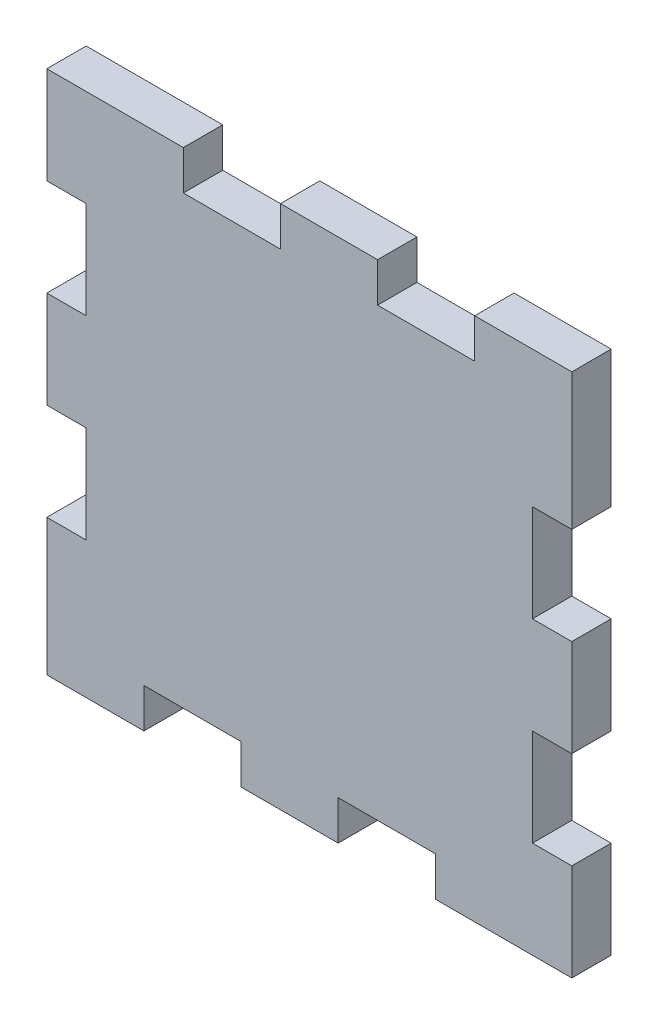
ISO-10303-21;
HEADER;
FILE_DESCRIPTION(('STEP AP214'),'2;1');
FILE_NAME('part.step','',(''),(''),'','','');
FILE_SCHEMA(('AUTOMOTIVE_DESIGN { 1 0 10303 214 1 1 1 1 }'));
ENDSEC;
DATA;
#1=APPLICATION_CONTEXT('core data for automotive mechanical design processes');
#2=APPLICATION_PROTOCOL_DEFINITION('international standard','automotive_design',2000,#1);
#3=PRODUCT_CONTEXT('',#1,'mechanical');
#4=PRODUCT('Part','Part','',(#3));
#5=PRODUCT_RELATED_PRODUCT_CATEGORY('part','',(#4));
#6=PRODUCT_DEFINITION_FORMATION('','',#4);
#7=PRODUCT_DEFINITION_CONTEXT('part definition',#1,'design');
#8=PRODUCT_DEFINITION('design','',#6,#7);
#9=PRODUCT_DEFINITION_SHAPE('','',#8);
#10=(LENGTH_UNIT() NAMED_UNIT(*) SI_UNIT(.MILLI.,.METRE.));
#11=(NAMED_UNIT(*) PLANE_ANGLE_UNIT() SI_UNIT($,.RADIAN.));
#12=(NAMED_UNIT(*) SI_UNIT($,.STERADIAN.) SOLID_ANGLE_UNIT());
#13=UNCERTAINTY_MEASURE_WITH_UNIT(LENGTH_MEASURE(1.E-05),#10,'distance_accuracy_value','');
#14=(GEOMETRIC_REPRESENTATION_CONTEXT(3) GLOBAL_UNCERTAINTY_ASSIGNED_CONTEXT((#13)) GLOBAL_UNIT_ASSIGNED_CONTEXT((#10,
#11,#12)) REPRESENTATION_CONTEXT('',''));
#15=CARTESIAN_POINT('',(0.,0.,0.));
#16=DIRECTION('',(0.,0.,1.));
#17=DIRECTION('',(1.,0.,0.));
#18=AXIS2_PLACEMENT_3D('',#15,#16,#17);
#19=CARTESIAN_POINT('',(0.,0.,4.5));
#20=DIRECTION('',(1.,0.,0.));
#21=DIRECTION('',(0.,0.,-1.));
#22=AXIS2_PLACEMENT_3D('',#19,#20,#21);
#23=PLANE('',#22);
#24=DIRECTION('',(0.,0.,1.));
#25=VECTOR('',#24,1.);
#26=CARTESIAN_POINT('',(0.,48.9,0.));
#27=LINE('',#26,#25);
#28=CARTESIAN_POINT('',(0.,48.9,0.));
#29=VERTEX_POINT('',#28);
#30=CARTESIAN_POINT('',(0.,48.9,4.5));
#31=VERTEX_POINT('',#30);
#32=EDGE_CURVE('E368',#29,#31,#27,.T.);
#33=ORIENTED_EDGE('',*,*,#32,.T.);
#34=DIRECTION('',(0.,-1.,0.));
#35=VECTOR('',#34,1.);
#36=CARTESIAN_POINT('',(0.,0.,4.5));
#37=LINE('',#36,#35);
#38=CARTESIAN_POINT('',(0.,60.,4.5));
#39=VERTEX_POINT('',#38);
#40=EDGE_CURVE('E458',#39,#31,#37,.T.);
#41=ORIENTED_EDGE('',*,*,#40,.F.);
#42=DIRECTION('',(0.,0.,-1.));
#43=VECTOR('',#42,1.);
#44=CARTESIAN_POINT('',(0.,60.,4.5));
#45=LINE('',#44,#43);
#46=CARTESIAN_POINT('',(0.,60.,0.));
#47=VERTEX_POINT('',#46);
#48=EDGE_CURVE('E477',#39,#47,#45,.T.);
#49=ORIENTED_EDGE('',*,*,#48,.T.);
#50=DIRECTION('',(0.,-1.,0.));
#51=VECTOR('',#50,1.);
#52=CARTESIAN_POINT('',(0.,0.,0.));
#53=LINE('',#52,#51);
#54=EDGE_CURVE('E479',#47,#29,#53,.T.);
#55=ORIENTED_EDGE('',*,*,#54,.T.);
#56=EDGE_LOOP('',(#33,#41,#49,#55));
#57=FACE_BOUND('',#56,.T.);
#58=ADVANCED_FACE('F31',(#57),#23,.F.);
#59=DIRECTION('',(0.,0.,-1.));
#60=VECTOR('',#59,1.);
#61=CARTESIAN_POINT('',(0.,37.8,0.));
#62=LINE('',#61,#60);
#63=CARTESIAN_POINT('',(0.,37.8,4.5));
#64=VERTEX_POINT('',#63);
#65=CARTESIAN_POINT('',(0.,37.8,0.));
#66=VERTEX_POINT('',#65);
#67=EDGE_CURVE('E387',#64,#66,#62,.T.);
#68=ORIENTED_EDGE('',*,*,#67,.T.);
#69=CARTESIAN_POINT('',(0.,26.7,0.));
#70=VERTEX_POINT('',#69);
#71=EDGE_CURVE('E483',#66,#70,#53,.T.);
#72=ORIENTED_EDGE('',*,*,#71,.T.);
#73=DIRECTION('',(0.,0.,1.));
#74=VECTOR('',#73,1.);
#75=CARTESIAN_POINT('',(0.,26.7,0.));
#76=LINE('',#75,#74);
#77=CARTESIAN_POINT('',(0.,26.7,4.5));
#78=VERTEX_POINT('',#77);
#79=EDGE_CURVE('E390',#70,#78,#76,.T.);
#80=ORIENTED_EDGE('',*,*,#79,.T.);
#81=EDGE_CURVE('E462',#64,#78,#37,.T.);
#82=ORIENTED_EDGE('',*,*,#81,.F.);
#83=EDGE_LOOP('',(#68,#72,#80,#82));
#84=FACE_BOUND('',#83,.T.);
#85=ADVANCED_FACE('F518',(#84),#23,.F.);
#86=DIRECTION('',(0.,0.,-1.));
#87=VECTOR('',#86,1.);
#88=CARTESIAN_POINT('',(0.,15.6,0.));
#89=LINE('',#88,#87);
#90=CARTESIAN_POINT('',(0.,15.6,4.5));
#91=VERTEX_POINT('',#90);
#92=CARTESIAN_POINT('',(0.,15.6,0.));
#93=VERTEX_POINT('',#92);
#94=EDGE_CURVE('E372',#91,#93,#89,.T.);
#95=ORIENTED_EDGE('',*,*,#94,.T.);
#96=CARTESIAN_POINT('',(0.,0.,0.));
#97=VERTEX_POINT('',#96);
#98=EDGE_CURVE('E457',#93,#97,#53,.T.);
#99=ORIENTED_EDGE('',*,*,#98,.T.);
#100=DIRECTION('',(0.,0.,-1.));
#101=VECTOR('',#100,1.);
#102=CARTESIAN_POINT('',(0.,0.,4.5));
#103=LINE('',#102,#101);
#104=CARTESIAN_POINT('',(0.,0.,4.5));
#105=VERTEX_POINT('',#104);
#106=EDGE_CURVE('E298',#105,#97,#103,.T.);
#107=ORIENTED_EDGE('',*,*,#106,.F.);
#108=EDGE_CURVE('E463',#91,#105,#37,.T.);
#109=ORIENTED_EDGE('',*,*,#108,.F.);
#110=EDGE_LOOP('',(#95,#99,#107,#109));
#111=FACE_BOUND('',#110,.T.);
#112=ADVANCED_FACE('F513',(#111),#23,.F.);
#113=CARTESIAN_POINT('',(0.,0.,4.5));
#114=DIRECTION('',(0.,1.,0.));
#115=DIRECTION('',(0.,0.,1.));
#116=AXIS2_PLACEMENT_3D('',#113,#114,#115);
#117=PLANE('',#116);
#118=DIRECTION('',(0.,0.,1.));
#119=VECTOR('',#118,1.);
#120=CARTESIAN_POINT('',(11.1,0.,0.));
#121=LINE('',#120,#119);
#122=CARTESIAN_POINT('',(11.1,0.,0.));
#123=VERTEX_POINT('',#122);
#124=CARTESIAN_POINT('',(11.1,0.,4.5));
#125=VERTEX_POINT('',#124);
#126=EDGE_CURVE('E268',#123,#125,#121,.T.);
#127=ORIENTED_EDGE('',*,*,#126,.T.);
#128=DIRECTION('',(1.,0.,0.));
#129=VECTOR('',#128,1.);
#130=CARTESIAN_POINT('',(0.,0.,4.5));
#131=LINE('',#130,#129);
#132=EDGE_CURVE('E464',#105,#125,#131,.T.);
#133=ORIENTED_EDGE('',*,*,#132,.F.);
#134=ORIENTED_EDGE('',*,*,#106,.T.);
#135=DIRECTION('',(1.,0.,0.));
#136=VECTOR('',#135,1.);
#137=CARTESIAN_POINT('',(0.,0.,0.));
#138=LINE('',#137,#136);
#139=EDGE_CURVE('E484',#97,#123,#138,.T.);
#140=ORIENTED_EDGE('',*,*,#139,.T.);
#141=EDGE_LOOP('',(#127,#133,#134,#140));
#142=FACE_BOUND('',#141,.T.);
#143=ADVANCED_FACE('F510',(#142),#117,.F.);
#144=DIRECTION('',(0.,0.,-1.));
#145=VECTOR('',#144,1.);
#146=CARTESIAN_POINT('',(22.2,0.,0.));
#147=LINE('',#146,#145);
#148=CARTESIAN_POINT('',(22.2,0.,4.5));
#149=VERTEX_POINT('',#148);
#150=CARTESIAN_POINT('',(22.2,0.,0.));
#151=VERTEX_POINT('',#150);
#152=EDGE_CURVE('E584',#149,#151,#147,.T.);
#153=ORIENTED_EDGE('',*,*,#152,.T.);
#154=CARTESIAN_POINT('',(33.3,0.,0.));
#155=VERTEX_POINT('',#154);
#156=EDGE_CURVE('E487',#151,#155,#138,.T.);
#157=ORIENTED_EDGE('',*,*,#156,.T.);
#158=DIRECTION('',(0.,0.,1.));
#159=VECTOR('',#158,1.);
#160=CARTESIAN_POINT('',(33.3,0.,0.));
#161=LINE('',#160,#159);
#162=CARTESIAN_POINT('',(33.3,0.,4.5));
#163=VERTEX_POINT('',#162);
#164=EDGE_CURVE('E575',#155,#163,#161,.T.);
#165=ORIENTED_EDGE('',*,*,#164,.T.);
#166=EDGE_CURVE('E468',#149,#163,#131,.T.);
#167=ORIENTED_EDGE('',*,*,#166,.F.);
#168=EDGE_LOOP('',(#153,#157,#165,#167));
#169=FACE_BOUND('',#168,.T.);
#170=ADVANCED_FACE('F555',(#169),#117,.F.);
#171=DIRECTION('',(0.,0.,-1.));
#172=VECTOR('',#171,1.);
#173=CARTESIAN_POINT('',(44.4,0.,0.));
#174=LINE('',#173,#172);
#175=CARTESIAN_POINT('',(44.4,0.,4.5));
#176=VERTEX_POINT('',#175);
#177=CARTESIAN_POINT('',(44.4,0.,0.));
#178=VERTEX_POINT('',#177);
#179=EDGE_CURVE('E285',#176,#178,#174,.T.);
#180=ORIENTED_EDGE('',*,*,#179,.T.);
#181=CARTESIAN_POINT('',(60.,0.,0.));
#182=VERTEX_POINT('',#181);
#183=EDGE_CURVE('E482',#178,#182,#138,.T.);
#184=ORIENTED_EDGE('',*,*,#183,.T.);
#185=DIRECTION('',(0.,0.,-1.));
#186=VECTOR('',#185,1.);
#187=CARTESIAN_POINT('',(60.,0.,4.5));
#188=LINE('',#187,#186);
#189=CARTESIAN_POINT('',(60.,0.,4.5));
#190=VERTEX_POINT('',#189);
#191=EDGE_CURVE('E500',#190,#182,#188,.T.);
#192=ORIENTED_EDGE('',*,*,#191,.F.);
#193=EDGE_CURVE('E461',#176,#190,#131,.T.);
#194=ORIENTED_EDGE('',*,*,#193,.F.);
#195=EDGE_LOOP('',(#180,#184,#192,#194));
#196=FACE_BOUND('',#195,.T.);
#197=ADVANCED_FACE('F556',(#196),#117,.F.);
#198=CARTESIAN_POINT('',(60.,0.,4.5));
#199=DIRECTION('',(-1.,0.,0.));
#200=DIRECTION('',(0.,0.,1.));
#201=AXIS2_PLACEMENT_3D('',#198,#199,#200);
#202=PLANE('',#201);
#203=DIRECTION('',(0.,0.,1.));
#204=VECTOR('',#203,1.);
#205=CARTESIAN_POINT('',(60.,11.1,0.));
#206=LINE('',#205,#204);
#207=CARTESIAN_POINT('',(60.,11.1,0.));
#208=VERTEX_POINT('',#207);
#209=CARTESIAN_POINT('',(60.,11.1,4.5));
#210=VERTEX_POINT('',#209);
#211=EDGE_CURVE('E413',#208,#210,#206,.T.);
#212=ORIENTED_EDGE('',*,*,#211,.T.);
#213=DIRECTION('',(0.,1.,0.));
#214=VECTOR('',#213,1.);
#215=CARTESIAN_POINT('',(60.,0.,4.5));
#216=LINE('',#215,#214);
#217=EDGE_CURVE('E469',#190,#210,#216,.T.);
#218=ORIENTED_EDGE('',*,*,#217,.F.);
#219=ORIENTED_EDGE('',*,*,#191,.T.);
#220=DIRECTION('',(0.,1.,0.));
#221=VECTOR('',#220,1.);
#222=CARTESIAN_POINT('',(60.,0.,0.));
#223=LINE('',#222,#221);
#224=EDGE_CURVE('E488',#182,#208,#223,.T.);
#225=ORIENTED_EDGE('',*,*,#224,.T.);
#226=EDGE_LOOP('',(#212,#218,#219,#225));
#227=FACE_BOUND('',#226,.T.);
#228=ADVANCED_FACE('F563',(#227),#202,.F.);
#229=DIRECTION('',(0.,0.,-1.));
#230=VECTOR('',#229,1.);
#231=CARTESIAN_POINT('',(60.,22.2,0.));
#232=LINE('',#231,#230);
#233=CARTESIAN_POINT('',(60.,22.2,4.5));
#234=VERTEX_POINT('',#233);
#235=CARTESIAN_POINT('',(60.,22.2,0.));
#236=VERTEX_POINT('',#235);
#237=EDGE_CURVE('E430',#234,#236,#232,.T.);
#238=ORIENTED_EDGE('',*,*,#237,.T.);
#239=CARTESIAN_POINT('',(60.,33.3,0.));
#240=VERTEX_POINT('',#239);
#241=EDGE_CURVE('E492',#236,#240,#223,.T.);
#242=ORIENTED_EDGE('',*,*,#241,.T.);
#243=DIRECTION('',(0.,0.,1.));
#244=VECTOR('',#243,1.);
#245=CARTESIAN_POINT('',(60.,33.3,0.));
#246=LINE('',#245,#244);
#247=CARTESIAN_POINT('',(60.,33.3,4.5));
#248=VERTEX_POINT('',#247);
#249=EDGE_CURVE('E433',#240,#248,#246,.T.);
#250=ORIENTED_EDGE('',*,*,#249,.T.);
#251=EDGE_CURVE('E473',#234,#248,#216,.T.);
#252=ORIENTED_EDGE('',*,*,#251,.F.);
#253=EDGE_LOOP('',(#238,#242,#250,#252));
#254=FACE_BOUND('',#253,.T.);
#255=ADVANCED_FACE('F568',(#254),#202,.F.);
#256=DIRECTION('',(0.,0.,-1.));
#257=VECTOR('',#256,1.);
#258=CARTESIAN_POINT('',(60.,44.4,0.));
#259=LINE('',#258,#257);
#260=CARTESIAN_POINT('',(60.,44.4,4.5));
#261=VERTEX_POINT('',#260);
#262=CARTESIAN_POINT('',(60.,44.4,0.));
#263=VERTEX_POINT('',#262);
#264=EDGE_CURVE('E417',#261,#263,#259,.T.);
#265=ORIENTED_EDGE('',*,*,#264,.T.);
#266=CARTESIAN_POINT('',(60.,60.,0.));
#267=VERTEX_POINT('',#266);
#268=EDGE_CURVE('E486',#263,#267,#223,.T.);
#269=ORIENTED_EDGE('',*,*,#268,.T.);
#270=DIRECTION('',(0.,0.,-1.));
#271=VECTOR('',#270,1.);
#272=CARTESIAN_POINT('',(60.,60.,4.5));
#273=LINE('',#272,#271);
#274=CARTESIAN_POINT('',(60.,60.,4.5));
#275=VERTEX_POINT('',#274);
#276=EDGE_CURVE('E498',#275,#267,#273,.T.);
#277=ORIENTED_EDGE('',*,*,#276,.F.);
#278=EDGE_CURVE('E467',#261,#275,#216,.T.);
#279=ORIENTED_EDGE('',*,*,#278,.F.);
#280=EDGE_LOOP('',(#265,#269,#277,#279));
#281=FACE_BOUND('',#280,.T.);
#282=ADVANCED_FACE('F569',(#281),#202,.F.);
#283=CARTESIAN_POINT('',(0.,60.,4.5));
#284=DIRECTION('',(0.,-1.,0.));
#285=DIRECTION('',(0.,0.,-1.));
#286=AXIS2_PLACEMENT_3D('',#283,#284,#285);
#287=PLANE('',#286);
#288=DIRECTION('',(0.,0.,1.));
#289=VECTOR('',#288,1.);
#290=CARTESIAN_POINT('',(48.9,60.,0.));
#291=LINE('',#290,#289);
#292=CARTESIAN_POINT('',(48.9,60.,0.));
#293=VERTEX_POINT('',#292);
#294=CARTESIAN_POINT('',(48.9,60.,4.5));
#295=VERTEX_POINT('',#294);
#296=EDGE_CURVE('E273',#293,#295,#291,.T.);
#297=ORIENTED_EDGE('',*,*,#296,.T.);
#298=DIRECTION('',(-1.,0.,0.));
#299=VECTOR('',#298,1.);
#300=CARTESIAN_POINT('',(0.,60.,4.5));
#301=LINE('',#300,#299);
#302=EDGE_CURVE('E474',#275,#295,#301,.T.);
#303=ORIENTED_EDGE('',*,*,#302,.F.);
#304=ORIENTED_EDGE('',*,*,#276,.T.);
#305=DIRECTION('',(-1.,0.,0.));
#306=VECTOR('',#305,1.);
#307=CARTESIAN_POINT('',(0.,60.,0.));
#308=LINE('',#307,#306);
#309=EDGE_CURVE('E493',#267,#293,#308,.T.);
#310=ORIENTED_EDGE('',*,*,#309,.T.);
#311=EDGE_LOOP('',(#297,#303,#304,#310));
#312=FACE_BOUND('',#311,.T.);
#313=ADVANCED_FACE('F690',(#312),#287,.F.);
#314=DIRECTION('',(0.,0.,-1.));
#315=VECTOR('',#314,1.);
#316=CARTESIAN_POINT('',(37.8,60.,0.));
#317=LINE('',#316,#315);
#318=CARTESIAN_POINT('',(37.8,60.,4.5));
#319=VERTEX_POINT('',#318);
#320=CARTESIAN_POINT('',(37.8,60.,0.));
#321=VERTEX_POINT('',#320);
#322=EDGE_CURVE('E347',#319,#321,#317,.T.);
#323=ORIENTED_EDGE('',*,*,#322,.T.);
#324=CARTESIAN_POINT('',(26.7,60.,0.));
#325=VERTEX_POINT('',#324);
#326=EDGE_CURVE('E495',#321,#325,#308,.T.);
#327=ORIENTED_EDGE('',*,*,#326,.T.);
#328=DIRECTION('',(0.,0.,1.));
#329=VECTOR('',#328,1.);
#330=CARTESIAN_POINT('',(26.7,60.,0.));
#331=LINE('',#330,#329);
#332=CARTESIAN_POINT('',(26.7,60.,4.5));
#333=VERTEX_POINT('',#332);
#334=EDGE_CURVE('E332',#325,#333,#331,.T.);
#335=ORIENTED_EDGE('',*,*,#334,.T.);
#336=EDGE_CURVE('E478',#319,#333,#301,.T.);
#337=ORIENTED_EDGE('',*,*,#336,.F.);
#338=EDGE_LOOP('',(#323,#327,#335,#337));
#339=FACE_BOUND('',#338,.T.);
#340=ADVANCED_FACE('F677',(#339),#287,.F.);
#341=DIRECTION('',(0.,0.,-1.));
#342=VECTOR('',#341,1.);
#343=CARTESIAN_POINT('',(15.6,60.,0.));
#344=LINE('',#343,#342);
#345=CARTESIAN_POINT('',(15.6,60.,4.5));
#346=VERTEX_POINT('',#345);
#347=CARTESIAN_POINT('',(15.6,60.,0.));
#348=VERTEX_POINT('',#347);
#349=EDGE_CURVE('E328',#346,#348,#344,.T.);
#350=ORIENTED_EDGE('',*,*,#349,.T.);
#351=EDGE_CURVE('E491',#348,#47,#308,.T.);
#352=ORIENTED_EDGE('',*,*,#351,.T.);
#353=ORIENTED_EDGE('',*,*,#48,.F.);
#354=EDGE_CURVE('E472',#346,#39,#301,.T.);
#355=ORIENTED_EDGE('',*,*,#354,.F.);
#356=EDGE_LOOP('',(#350,#352,#353,#355));
#357=FACE_BOUND('',#356,.T.);
#358=ADVANCED_FACE('F687',(#357),#287,.F.);
#359=CARTESIAN_POINT('',(0.,60.,4.5));
#360=DIRECTION('',(0.,0.,-1.));
#361=DIRECTION('',(-1.,0.,0.));
#362=AXIS2_PLACEMENT_3D('',#359,#360,#361);
#363=PLANE('',#362);
#364=DIRECTION('',(1.,0.,0.));
#365=VECTOR('',#364,1.);
#366=CARTESIAN_POINT('',(55.5,11.1,4.5));
#367=LINE('',#366,#365);
#368=CARTESIAN_POINT('',(55.5,11.1,4.5));
#369=VERTEX_POINT('',#368);
#370=EDGE_CURVE('E452',#369,#210,#367,.T.);
#371=ORIENTED_EDGE('',*,*,#370,.F.);
#372=DIRECTION('',(0.,1.,0.));
#373=VECTOR('',#372,1.);
#374=CARTESIAN_POINT('',(55.5,11.1,4.5));
#375=LINE('',#374,#373);
#376=CARTESIAN_POINT('',(55.5,22.2,4.5));
#377=VERTEX_POINT('',#376);
#378=EDGE_CURVE('E416',#369,#377,#375,.T.);
#379=ORIENTED_EDGE('',*,*,#378,.T.);
#380=DIRECTION('',(1.,0.,0.));
#381=VECTOR('',#380,1.);
#382=CARTESIAN_POINT('',(55.5,22.2,4.5));
#383=LINE('',#382,#381);
#384=EDGE_CURVE('E449',#377,#234,#383,.T.);
#385=ORIENTED_EDGE('',*,*,#384,.T.);
#386=ORIENTED_EDGE('',*,*,#251,.T.);
#387=DIRECTION('',(1.,0.,0.));
#388=VECTOR('',#387,1.);
#389=CARTESIAN_POINT('',(55.5,33.3,4.5));
#390=LINE('',#389,#388);
#391=CARTESIAN_POINT('',(55.5,33.3,4.5));
#392=VERTEX_POINT('',#391);
#393=EDGE_CURVE('E442',#392,#248,#390,.T.);
#394=ORIENTED_EDGE('',*,*,#393,.F.);
#395=DIRECTION('',(0.,1.,0.));
#396=VECTOR('',#395,1.);
#397=CARTESIAN_POINT('',(55.5,33.3,4.5));
#398=LINE('',#397,#396);
#399=CARTESIAN_POINT('',(55.5,44.4,4.5));
#400=VERTEX_POINT('',#399);
#401=EDGE_CURVE('E423',#392,#400,#398,.T.);
#402=ORIENTED_EDGE('',*,*,#401,.T.);
#403=DIRECTION('',(1.,0.,0.));
#404=VECTOR('',#403,1.);
#405=CARTESIAN_POINT('',(55.5,44.4,4.5));
#406=LINE('',#405,#404);
#407=EDGE_CURVE('E439',#400,#261,#406,.T.);
#408=ORIENTED_EDGE('',*,*,#407,.T.);
#409=ORIENTED_EDGE('',*,*,#278,.T.);
#410=ORIENTED_EDGE('',*,*,#302,.T.);
#411=DIRECTION('',(0.,1.,0.));
#412=VECTOR('',#411,1.);
#413=CARTESIAN_POINT('',(48.9,55.5,4.5));
#414=LINE('',#413,#412);
#415=CARTESIAN_POINT('',(48.9,55.5,4.5));
#416=VERTEX_POINT('',#415);
#417=EDGE_CURVE('E365',#416,#295,#414,.T.);
#418=ORIENTED_EDGE('',*,*,#417,.F.);
#419=DIRECTION('',(-1.,0.,0.));
#420=VECTOR('',#419,1.);
#421=CARTESIAN_POINT('',(48.9,55.5,4.5));
#422=LINE('',#421,#420);
#423=CARTESIAN_POINT('',(37.8,55.5,4.5));
#424=VERTEX_POINT('',#423);
#425=EDGE_CURVE('E325',#416,#424,#422,.T.);
#426=ORIENTED_EDGE('',*,*,#425,.T.);
#427=DIRECTION('',(0.,1.,0.));
#428=VECTOR('',#427,1.);
#429=CARTESIAN_POINT('',(37.8,55.5,4.5));
#430=LINE('',#429,#428);
#431=EDGE_CURVE('E362',#424,#319,#430,.T.);
#432=ORIENTED_EDGE('',*,*,#431,.T.);
#433=ORIENTED_EDGE('',*,*,#336,.T.);
#434=DIRECTION('',(0.,1.,0.));
#435=VECTOR('',#434,1.);
#436=CARTESIAN_POINT('',(26.7,55.5,4.5));
#437=LINE('',#436,#435);
#438=CARTESIAN_POINT('',(26.7,55.5,4.5));
#439=VERTEX_POINT('',#438);
#440=EDGE_CURVE('E356',#439,#333,#437,.T.);
#441=ORIENTED_EDGE('',*,*,#440,.F.);
#442=DIRECTION('',(-1.,0.,0.));
#443=VECTOR('',#442,1.);
#444=CARTESIAN_POINT('',(26.7,55.5,4.5));
#445=LINE('',#444,#443);
#446=CARTESIAN_POINT('',(15.6,55.5,4.5));
#447=VERTEX_POINT('',#446);
#448=EDGE_CURVE('E339',#439,#447,#445,.T.);
#449=ORIENTED_EDGE('',*,*,#448,.T.);
#450=DIRECTION('',(0.,1.,0.));
#451=VECTOR('',#450,1.);
#452=CARTESIAN_POINT('',(15.6,55.5,4.5));
#453=LINE('',#452,#451);
#454=EDGE_CURVE('E353',#447,#346,#453,.T.);
#455=ORIENTED_EDGE('',*,*,#454,.T.);
#456=ORIENTED_EDGE('',*,*,#354,.T.);
#457=ORIENTED_EDGE('',*,*,#40,.T.);
#458=DIRECTION('',(-1.,0.,0.));
#459=VECTOR('',#458,1.);
#460=CARTESIAN_POINT('',(4.5,48.9,4.5));
#461=LINE('',#460,#459);
#462=CARTESIAN_POINT('',(4.5,48.9,4.5));
#463=VERTEX_POINT('',#462);
#464=EDGE_CURVE('E408',#463,#31,#461,.T.);
#465=ORIENTED_EDGE('',*,*,#464,.F.);
#466=DIRECTION('',(0.,-1.,0.));
#467=VECTOR('',#466,1.);
#468=CARTESIAN_POINT('',(4.5,48.9,4.5));
#469=LINE('',#468,#467);
#470=CARTESIAN_POINT('',(4.5,37.8,4.5));
#471=VERTEX_POINT('',#470);
#472=EDGE_CURVE('E371',#463,#471,#469,.T.);
#473=ORIENTED_EDGE('',*,*,#472,.T.);
#474=DIRECTION('',(-1.,0.,0.));
#475=VECTOR('',#474,1.);
#476=CARTESIAN_POINT('',(4.5,37.8,4.5));
#477=LINE('',#476,#475);
#478=EDGE_CURVE('E405',#471,#64,#477,.T.);
#479=ORIENTED_EDGE('',*,*,#478,.T.);
#480=ORIENTED_EDGE('',*,*,#81,.T.);
#481=DIRECTION('',(-1.,0.,0.));
#482=VECTOR('',#481,1.);
#483=CARTESIAN_POINT('',(4.5,26.7,4.5));
#484=LINE('',#483,#482);
#485=CARTESIAN_POINT('',(4.5,26.7,4.5));
#486=VERTEX_POINT('',#485);
#487=EDGE_CURVE('E399',#486,#78,#484,.T.);
#488=ORIENTED_EDGE('',*,*,#487,.F.);
#489=DIRECTION('',(0.,-1.,0.));
#490=VECTOR('',#489,1.);
#491=CARTESIAN_POINT('',(4.5,26.7,4.5));
#492=LINE('',#491,#490);
#493=CARTESIAN_POINT('',(4.5,15.6,4.5));
#494=VERTEX_POINT('',#493);
#495=EDGE_CURVE('E379',#486,#494,#492,.T.);
#496=ORIENTED_EDGE('',*,*,#495,.T.);
#497=DIRECTION('',(-1.,0.,0.));
#498=VECTOR('',#497,1.);
#499=CARTESIAN_POINT('',(4.5,15.6,4.5));
#500=LINE('',#499,#498);
#501=EDGE_CURVE('E396',#494,#91,#500,.T.);
#502=ORIENTED_EDGE('',*,*,#501,.T.);
#503=ORIENTED_EDGE('',*,*,#108,.T.);
#504=ORIENTED_EDGE('',*,*,#132,.T.);
#505=DIRECTION('',(0.,-1.,0.));
#506=VECTOR('',#505,1.);
#507=CARTESIAN_POINT('',(11.1,4.5,4.5));
#508=LINE('',#507,#506);
#509=CARTESIAN_POINT('',(11.1,4.5,4.5));
#510=VERTEX_POINT('',#509);
#511=EDGE_CURVE('E274',#510,#125,#508,.T.);
#512=ORIENTED_EDGE('',*,*,#511,.F.);
#513=DIRECTION('',(1.,0.,0.));
#514=VECTOR('',#513,1.);
#515=CARTESIAN_POINT('',(11.1,4.5,4.5));
#516=LINE('',#515,#514);
#517=CARTESIAN_POINT('',(22.2,4.5,4.5));
#518=VERTEX_POINT('',#517);
#519=EDGE_CURVE('E283',#510,#518,#516,.T.);
#520=ORIENTED_EDGE('',*,*,#519,.T.);
#521=DIRECTION('',(0.,-1.,0.));
#522=VECTOR('',#521,1.);
#523=CARTESIAN_POINT('',(22.2,4.5,4.5));
#524=LINE('',#523,#522);
#525=EDGE_CURVE('E592',#518,#149,#524,.T.);
#526=ORIENTED_EDGE('',*,*,#525,.T.);
#527=ORIENTED_EDGE('',*,*,#166,.T.);
#528=DIRECTION('',(0.,-1.,0.));
#529=VECTOR('',#528,1.);
#530=CARTESIAN_POINT('',(33.3,4.5,4.5));
#531=LINE('',#530,#529);
#532=CARTESIAN_POINT('',(33.3,4.5,4.5));
#533=VERTEX_POINT('',#532);
#534=EDGE_CURVE('E590',#533,#163,#531,.T.);
#535=ORIENTED_EDGE('',*,*,#534,.F.);
#536=DIRECTION('',(1.,0.,0.));
#537=VECTOR('',#536,1.);
#538=CARTESIAN_POINT('',(33.3,4.5,4.5));
#539=LINE('',#538,#537);
#540=CARTESIAN_POINT('',(44.4,4.5,4.5));
#541=VERTEX_POINT('',#540);
#542=EDGE_CURVE('E609',#533,#541,#539,.T.);
#543=ORIENTED_EDGE('',*,*,#542,.T.);
#544=DIRECTION('',(0.,-1.,0.));
#545=VECTOR('',#544,1.);
#546=CARTESIAN_POINT('',(44.4,4.5,4.5));
#547=LINE('',#546,#545);
#548=EDGE_CURVE('E594',#541,#176,#547,.T.);
#549=ORIENTED_EDGE('',*,*,#548,.T.);
#550=ORIENTED_EDGE('',*,*,#193,.T.);
#551=ORIENTED_EDGE('',*,*,#217,.T.);
#552=EDGE_LOOP('',(#371,#379,#385,#386,#394,#402,#408,#409,#410,#418,#426,#432,#433,#441,#449,
#455,#456,#457,#465,#473,#479,#480,#488,#496,#502,#503,#504,#512,#520,#526,#527,#535,#543,#549,
#550,#551));
#553=FACE_BOUND('',#552,.T.);
#554=ADVANCED_FACE('F532',(#553),#363,.F.);
#555=CARTESIAN_POINT('',(0.,60.,0.));
#556=DIRECTION('',(0.,0.,-1.));
#557=DIRECTION('',(-1.,0.,0.));
#558=AXIS2_PLACEMENT_3D('',#555,#556,#557);
#559=PLANE('',#558);
#560=DIRECTION('',(1.,0.,0.));
#561=VECTOR('',#560,1.);
#562=CARTESIAN_POINT('',(55.5,44.4,0.));
#563=LINE('',#562,#561);
#564=CARTESIAN_POINT('',(55.5,44.4,0.));
#565=VERTEX_POINT('',#564);
#566=EDGE_CURVE('E427',#565,#263,#563,.T.);
#567=ORIENTED_EDGE('',*,*,#566,.F.);
#568=DIRECTION('',(0.,-1.,0.));
#569=VECTOR('',#568,1.);
#570=CARTESIAN_POINT('',(55.5,60.,0.));
#571=LINE('',#570,#569);
#572=CARTESIAN_POINT('',(55.5,33.3,0.));
#573=VERTEX_POINT('',#572);
#574=EDGE_CURVE('E11',#565,#573,#571,.T.);
#575=ORIENTED_EDGE('',*,*,#574,.T.);
#576=DIRECTION('',(1.,0.,0.));
#577=VECTOR('',#576,1.);
#578=CARTESIAN_POINT('',(55.5,33.3,0.));
#579=LINE('',#578,#577);
#580=EDGE_CURVE('E444',#573,#240,#579,.T.);
#581=ORIENTED_EDGE('',*,*,#580,.T.);
#582=ORIENTED_EDGE('',*,*,#241,.F.);
#583=DIRECTION('',(1.,0.,0.));
#584=VECTOR('',#583,1.);
#585=CARTESIAN_POINT('',(55.5,22.2,0.));
#586=LINE('',#585,#584);
#587=CARTESIAN_POINT('',(55.5,22.2,0.));
#588=VERTEX_POINT('',#587);
#589=EDGE_CURVE('E447',#588,#236,#586,.T.);
#590=ORIENTED_EDGE('',*,*,#589,.F.);
#591=CARTESIAN_POINT('',(55.5,11.1,0.));
#592=VERTEX_POINT('',#591);
#593=EDGE_CURVE('E38',#588,#592,#571,.T.);
#594=ORIENTED_EDGE('',*,*,#593,.T.);
#595=DIRECTION('',(1.,0.,0.));
#596=VECTOR('',#595,1.);
#597=CARTESIAN_POINT('',(55.5,11.1,0.));
#598=LINE('',#597,#596);
#599=EDGE_CURVE('E454',#592,#208,#598,.T.);
#600=ORIENTED_EDGE('',*,*,#599,.T.);
#601=ORIENTED_EDGE('',*,*,#224,.F.);
#602=ORIENTED_EDGE('',*,*,#183,.F.);
#603=DIRECTION('',(0.,-1.,0.));
#604=VECTOR('',#603,1.);
#605=CARTESIAN_POINT('',(44.4,4.5,0.));
#606=LINE('',#605,#604);
#607=CARTESIAN_POINT('',(44.4,4.5,0.));
#608=VERTEX_POINT('',#607);
#609=EDGE_CURVE('E578',#608,#178,#606,.T.);
#610=ORIENTED_EDGE('',*,*,#609,.F.);
#611=DIRECTION('',(-1.,0.,0.));
#612=VECTOR('',#611,1.);
#613=CARTESIAN_POINT('',(0.,4.5,0.));
#614=LINE('',#613,#612);
#615=CARTESIAN_POINT('',(33.3,4.5,0.));
#616=VERTEX_POINT('',#615);
#617=EDGE_CURVE('E292',#608,#616,#614,.T.);
#618=ORIENTED_EDGE('',*,*,#617,.T.);
#619=DIRECTION('',(0.,-1.,0.));
#620=VECTOR('',#619,1.);
#621=CARTESIAN_POINT('',(33.3,4.5,0.));
#622=LINE('',#621,#620);
#623=EDGE_CURVE('E586',#616,#155,#622,.T.);
#624=ORIENTED_EDGE('',*,*,#623,.T.);
#625=ORIENTED_EDGE('',*,*,#156,.F.);
#626=DIRECTION('',(0.,-1.,0.));
#627=VECTOR('',#626,1.);
#628=CARTESIAN_POINT('',(22.2,4.5,0.));
#629=LINE('',#628,#627);
#630=CARTESIAN_POINT('',(22.2,4.5,0.));
#631=VERTEX_POINT('',#630);
#632=EDGE_CURVE('E290',#631,#151,#629,.T.);
#633=ORIENTED_EDGE('',*,*,#632,.F.);
#634=CARTESIAN_POINT('',(11.1,4.5,0.));
#635=VERTEX_POINT('',#634);
#636=EDGE_CURVE('E280',#631,#635,#614,.T.);
#637=ORIENTED_EDGE('',*,*,#636,.T.);
#638=DIRECTION('',(0.,-1.,0.));
#639=VECTOR('',#638,1.);
#640=CARTESIAN_POINT('',(11.1,4.5,0.));
#641=LINE('',#640,#639);
#642=EDGE_CURVE('E262',#635,#123,#641,.T.);
#643=ORIENTED_EDGE('',*,*,#642,.T.);
#644=ORIENTED_EDGE('',*,*,#139,.F.);
#645=ORIENTED_EDGE('',*,*,#98,.F.);
#646=DIRECTION('',(-1.,0.,0.));
#647=VECTOR('',#646,1.);
#648=CARTESIAN_POINT('',(4.5,15.6,0.));
#649=LINE('',#648,#647);
#650=CARTESIAN_POINT('',(4.5,15.6,0.));
#651=VERTEX_POINT('',#650);
#652=EDGE_CURVE('E384',#651,#93,#649,.T.);
#653=ORIENTED_EDGE('',*,*,#652,.F.);
#654=DIRECTION('',(0.,1.,0.));
#655=VECTOR('',#654,1.);
#656=CARTESIAN_POINT('',(4.5,60.,0.));
#657=LINE('',#656,#655);
#658=CARTESIAN_POINT('',(4.5,26.7,0.));
#659=VERTEX_POINT('',#658);
#660=EDGE_CURVE('E301',#651,#659,#657,.T.);
#661=ORIENTED_EDGE('',*,*,#660,.T.);
#662=DIRECTION('',(-1.,0.,0.));
#663=VECTOR('',#662,1.);
#664=CARTESIAN_POINT('',(4.5,26.7,0.));
#665=LINE('',#664,#663);
#666=EDGE_CURVE('E401',#659,#70,#665,.T.);
#667=ORIENTED_EDGE('',*,*,#666,.T.);
#668=ORIENTED_EDGE('',*,*,#71,.F.);
#669=DIRECTION('',(-1.,0.,0.));
#670=VECTOR('',#669,1.);
#671=CARTESIAN_POINT('',(4.5,37.8,0.));
#672=LINE('',#671,#670);
#673=CARTESIAN_POINT('',(4.5,37.8,0.));
#674=VERTEX_POINT('',#673);
#675=EDGE_CURVE('E403',#674,#66,#672,.T.);
#676=ORIENTED_EDGE('',*,*,#675,.F.);
#677=CARTESIAN_POINT('',(4.5,48.9,0.));
#678=VERTEX_POINT('',#677);
#679=EDGE_CURVE('E303',#674,#678,#657,.T.);
#680=ORIENTED_EDGE('',*,*,#679,.T.);
#681=DIRECTION('',(-1.,0.,0.));
#682=VECTOR('',#681,1.);
#683=CARTESIAN_POINT('',(4.5,48.9,0.));
#684=LINE('',#683,#682);
#685=EDGE_CURVE('E410',#678,#29,#684,.T.);
#686=ORIENTED_EDGE('',*,*,#685,.T.);
#687=ORIENTED_EDGE('',*,*,#54,.F.);
#688=ORIENTED_EDGE('',*,*,#351,.F.);
#689=DIRECTION('',(0.,1.,0.));
#690=VECTOR('',#689,1.);
#691=CARTESIAN_POINT('',(15.6,55.5,0.));
#692=LINE('',#691,#690);
#693=CARTESIAN_POINT('',(15.6,55.5,0.));
#694=VERTEX_POINT('',#693);
#695=EDGE_CURVE('E344',#694,#348,#692,.T.);
#696=ORIENTED_EDGE('',*,*,#695,.F.);
#697=DIRECTION('',(1.,0.,0.));
#698=VECTOR('',#697,1.);
#699=CARTESIAN_POINT('',(0.,55.5,0.));
#700=LINE('',#699,#698);
#701=CARTESIAN_POINT('',(26.7,55.5,0.));
#702=VERTEX_POINT('',#701);
#703=EDGE_CURVE('E291',#694,#702,#700,.T.);
#704=ORIENTED_EDGE('',*,*,#703,.T.);
#705=DIRECTION('',(0.,1.,0.));
#706=VECTOR('',#705,1.);
#707=CARTESIAN_POINT('',(26.7,55.5,0.));
#708=LINE('',#707,#706);
#709=EDGE_CURVE('E358',#702,#325,#708,.T.);
#710=ORIENTED_EDGE('',*,*,#709,.T.);
#711=ORIENTED_EDGE('',*,*,#326,.F.);
#712=DIRECTION('',(0.,1.,0.));
#713=VECTOR('',#712,1.);
#714=CARTESIAN_POINT('',(37.8,55.5,0.));
#715=LINE('',#714,#713);
#716=CARTESIAN_POINT('',(37.8,55.5,0.));
#717=VERTEX_POINT('',#716);
#718=EDGE_CURVE('E316',#717,#321,#715,.T.);
#719=ORIENTED_EDGE('',*,*,#718,.F.);
#720=CARTESIAN_POINT('',(48.9,55.5,0.));
#721=VERTEX_POINT('',#720);
#722=EDGE_CURVE('E295',#717,#721,#700,.T.);
#723=ORIENTED_EDGE('',*,*,#722,.T.);
#724=DIRECTION('',(0.,1.,0.));
#725=VECTOR('',#724,1.);
#726=CARTESIAN_POINT('',(48.9,55.5,0.));
#727=LINE('',#726,#725);
#728=EDGE_CURVE('E313',#721,#293,#727,.T.);
#729=ORIENTED_EDGE('',*,*,#728,.T.);
#730=ORIENTED_EDGE('',*,*,#309,.F.);
#731=ORIENTED_EDGE('',*,*,#268,.F.);
#732=EDGE_LOOP('',(#567,#575,#581,#582,#590,#594,#600,#601,#602,#610,#618,#624,#625,#633,#637,
#643,#644,#645,#653,#661,#667,#668,#676,#680,#686,#687,#688,#696,#704,#710,#711,#719,#723,#729,
#730,#731));
#733=FACE_BOUND('',#732,.T.);
#734=ADVANCED_FACE('F288',(#733),#559,.T.);
#735=CARTESIAN_POINT('',(33.3,4.5,0.));
#736=DIRECTION('',(1.,0.,0.));
#737=DIRECTION('',(0.,0.,-1.));
#738=AXIS2_PLACEMENT_3D('',#735,#736,#737);
#739=PLANE('',#738);
#740=ORIENTED_EDGE('',*,*,#164,.F.);
#741=ORIENTED_EDGE('',*,*,#623,.F.);
#742=DIRECTION('',(0.,0.,1.));
#743=VECTOR('',#742,1.);
#744=CARTESIAN_POINT('',(33.3,4.5,0.));
#745=LINE('',#744,#743);
#746=EDGE_CURVE('E614',#616,#533,#745,.T.);
#747=ORIENTED_EDGE('',*,*,#746,.T.);
#748=ORIENTED_EDGE('',*,*,#534,.T.);
#749=EDGE_LOOP('',(#740,#741,#747,#748));
#750=FACE_BOUND('',#749,.T.);
#751=ADVANCED_FACE('F631',(#750),#739,.T.);
#752=CARTESIAN_POINT('',(44.4,4.5,0.));
#753=DIRECTION('',(-1.,0.,0.));
#754=DIRECTION('',(0.,0.,1.));
#755=AXIS2_PLACEMENT_3D('',#752,#753,#754);
#756=PLANE('',#755);
#757=ORIENTED_EDGE('',*,*,#179,.F.);
#758=ORIENTED_EDGE('',*,*,#548,.F.);
#759=DIRECTION('',(0.,0.,-1.));
#760=VECTOR('',#759,1.);
#761=CARTESIAN_POINT('',(44.4,4.5,0.));
#762=LINE('',#761,#760);
#763=EDGE_CURVE('E602',#541,#608,#762,.T.);
#764=ORIENTED_EDGE('',*,*,#763,.T.);
#765=ORIENTED_EDGE('',*,*,#609,.T.);
#766=EDGE_LOOP('',(#757,#758,#764,#765));
#767=FACE_BOUND('',#766,.T.);
#768=ADVANCED_FACE('F611',(#767),#756,.T.);
#769=CARTESIAN_POINT('',(0.,4.5,-14.2533333333333));
#770=DIRECTION('',(0.,-1.,0.));
#771=DIRECTION('',(-1.,0.,0.));
#772=AXIS2_PLACEMENT_3D('',#769,#770,#771);
#773=PLANE('',#772);
#774=ORIENTED_EDGE('',*,*,#763,.F.);
#775=ORIENTED_EDGE('',*,*,#542,.F.);
#776=ORIENTED_EDGE('',*,*,#746,.F.);
#777=ORIENTED_EDGE('',*,*,#617,.F.);
#778=EDGE_LOOP('',(#774,#775,#776,#777));
#779=FACE_BOUND('',#778,.T.);
#780=ADVANCED_FACE('F613',(#779),#773,.T.);
#781=CARTESIAN_POINT('',(11.1,4.5,0.));
#782=DIRECTION('',(1.,0.,0.));
#783=DIRECTION('',(0.,0.,-1.));
#784=AXIS2_PLACEMENT_3D('',#781,#782,#783);
#785=PLANE('',#784);
#786=ORIENTED_EDGE('',*,*,#126,.F.);
#787=ORIENTED_EDGE('',*,*,#642,.F.);
#788=DIRECTION('',(0.,0.,1.));
#789=VECTOR('',#788,1.);
#790=CARTESIAN_POINT('',(11.1,4.5,0.));
#791=LINE('',#790,#789);
#792=EDGE_CURVE('E265',#635,#510,#791,.T.);
#793=ORIENTED_EDGE('',*,*,#792,.T.);
#794=ORIENTED_EDGE('',*,*,#511,.T.);
#795=EDGE_LOOP('',(#786,#787,#793,#794));
#796=FACE_BOUND('',#795,.T.);
#797=ADVANCED_FACE('F264',(#796),#785,.T.);
#798=CARTESIAN_POINT('',(22.2,4.5,0.));
#799=DIRECTION('',(-1.,0.,0.));
#800=DIRECTION('',(0.,0.,1.));
#801=AXIS2_PLACEMENT_3D('',#798,#799,#800);
#802=PLANE('',#801);
#803=ORIENTED_EDGE('',*,*,#152,.F.);
#804=ORIENTED_EDGE('',*,*,#525,.F.);
#805=DIRECTION('',(0.,0.,-1.));
#806=VECTOR('',#805,1.);
#807=CARTESIAN_POINT('',(22.2,4.5,0.));
#808=LINE('',#807,#806);
#809=EDGE_CURVE('E615',#518,#631,#808,.T.);
#810=ORIENTED_EDGE('',*,*,#809,.T.);
#811=ORIENTED_EDGE('',*,*,#632,.T.);
#812=EDGE_LOOP('',(#803,#804,#810,#811));
#813=FACE_BOUND('',#812,.T.);
#814=ADVANCED_FACE('F620',(#813),#802,.T.);
#815=ORIENTED_EDGE('',*,*,#809,.F.);
#816=ORIENTED_EDGE('',*,*,#519,.F.);
#817=ORIENTED_EDGE('',*,*,#792,.F.);
#818=ORIENTED_EDGE('',*,*,#636,.F.);
#819=EDGE_LOOP('',(#815,#816,#817,#818));
#820=FACE_BOUND('',#819,.T.);
#821=ADVANCED_FACE('F279',(#820),#773,.T.);
#822=CARTESIAN_POINT('',(26.7,55.5,0.));
#823=DIRECTION('',(-1.,0.,0.));
#824=DIRECTION('',(0.,0.,-1.));
#825=AXIS2_PLACEMENT_3D('',#822,#823,#824);
#826=PLANE('',#825);
#827=ORIENTED_EDGE('',*,*,#334,.F.);
#828=ORIENTED_EDGE('',*,*,#709,.F.);
#829=DIRECTION('',(0.,0.,1.));
#830=VECTOR('',#829,1.);
#831=CARTESIAN_POINT('',(26.7,55.5,0.));
#832=LINE('',#831,#830);
#833=EDGE_CURVE('E337',#702,#439,#832,.T.);
#834=ORIENTED_EDGE('',*,*,#833,.T.);
#835=ORIENTED_EDGE('',*,*,#440,.T.);
#836=EDGE_LOOP('',(#827,#828,#834,#835));
#837=FACE_BOUND('',#836,.T.);
#838=ADVANCED_FACE('F627',(#837),#826,.T.);
#839=CARTESIAN_POINT('',(15.6,55.5,0.));
#840=DIRECTION('',(1.,0.,0.));
#841=DIRECTION('',(0.,0.,1.));
#842=AXIS2_PLACEMENT_3D('',#839,#840,#841);
#843=PLANE('',#842);
#844=ORIENTED_EDGE('',*,*,#349,.F.);
#845=ORIENTED_EDGE('',*,*,#454,.F.);
#846=DIRECTION('',(0.,0.,-1.));
#847=VECTOR('',#846,1.);
#848=CARTESIAN_POINT('',(15.6,55.5,0.));
#849=LINE('',#848,#847);
#850=EDGE_CURVE('E342',#447,#694,#849,.T.);
#851=ORIENTED_EDGE('',*,*,#850,.T.);
#852=ORIENTED_EDGE('',*,*,#695,.T.);
#853=EDGE_LOOP('',(#844,#845,#851,#852));
#854=FACE_BOUND('',#853,.T.);
#855=ADVANCED_FACE('F638',(#854),#843,.T.);
#856=CARTESIAN_POINT('',(60.,55.5,-14.2533333333333));
#857=DIRECTION('',(0.,1.,0.));
#858=DIRECTION('',(1.,0.,0.));
#859=AXIS2_PLACEMENT_3D('',#856,#857,#858);
#860=PLANE('',#859);
#861=ORIENTED_EDGE('',*,*,#850,.F.);
#862=ORIENTED_EDGE('',*,*,#448,.F.);
#863=ORIENTED_EDGE('',*,*,#833,.F.);
#864=ORIENTED_EDGE('',*,*,#703,.F.);
#865=EDGE_LOOP('',(#861,#862,#863,#864));
#866=FACE_BOUND('',#865,.T.);
#867=ADVANCED_FACE('F637',(#866),#860,.T.);
#868=CARTESIAN_POINT('',(48.9,55.5,0.));
#869=DIRECTION('',(-1.,0.,0.));
#870=DIRECTION('',(0.,0.,-1.));
#871=AXIS2_PLACEMENT_3D('',#868,#869,#870);
#872=PLANE('',#871);
#873=ORIENTED_EDGE('',*,*,#296,.F.);
#874=ORIENTED_EDGE('',*,*,#728,.F.);
#875=DIRECTION('',(0.,0.,1.));
#876=VECTOR('',#875,1.);
#877=CARTESIAN_POINT('',(48.9,55.5,0.));
#878=LINE('',#877,#876);
#879=EDGE_CURVE('E324',#721,#416,#878,.T.);
#880=ORIENTED_EDGE('',*,*,#879,.T.);
#881=ORIENTED_EDGE('',*,*,#417,.T.);
#882=EDGE_LOOP('',(#873,#874,#880,#881));
#883=FACE_BOUND('',#882,.T.);
#884=ADVANCED_FACE('F647',(#883),#872,.T.);
#885=CARTESIAN_POINT('',(37.8,55.5,0.));
#886=DIRECTION('',(1.,0.,0.));
#887=DIRECTION('',(0.,0.,1.));
#888=AXIS2_PLACEMENT_3D('',#885,#886,#887);
#889=PLANE('',#888);
#890=ORIENTED_EDGE('',*,*,#322,.F.);
#891=ORIENTED_EDGE('',*,*,#431,.F.);
#892=DIRECTION('',(0.,0.,-1.));
#893=VECTOR('',#892,1.);
#894=CARTESIAN_POINT('',(37.8,55.5,0.));
#895=LINE('',#894,#893);
#896=EDGE_CURVE('E322',#424,#717,#895,.T.);
#897=ORIENTED_EDGE('',*,*,#896,.T.);
#898=ORIENTED_EDGE('',*,*,#718,.T.);
#899=EDGE_LOOP('',(#890,#891,#897,#898));
#900=FACE_BOUND('',#899,.T.);
#901=ADVANCED_FACE('F636',(#900),#889,.T.);
#902=ORIENTED_EDGE('',*,*,#896,.F.);
#903=ORIENTED_EDGE('',*,*,#425,.F.);
#904=ORIENTED_EDGE('',*,*,#879,.F.);
#905=ORIENTED_EDGE('',*,*,#722,.F.);
#906=EDGE_LOOP('',(#902,#903,#904,#905));
#907=FACE_BOUND('',#906,.T.);
#908=ADVANCED_FACE('F320',(#907),#860,.T.);
#909=CARTESIAN_POINT('',(4.5,26.7,0.));
#910=DIRECTION('',(0.,-1.,0.));
#911=DIRECTION('',(0.,0.,-1.));
#912=AXIS2_PLACEMENT_3D('',#909,#910,#911);
#913=PLANE('',#912);
#914=ORIENTED_EDGE('',*,*,#79,.F.);
#915=ORIENTED_EDGE('',*,*,#666,.F.);
#916=DIRECTION('',(0.,0.,1.));
#917=VECTOR('',#916,1.);
#918=CARTESIAN_POINT('',(4.5,26.7,0.));
#919=LINE('',#918,#917);
#920=EDGE_CURVE('E377',#659,#486,#919,.T.);
#921=ORIENTED_EDGE('',*,*,#920,.T.);
#922=ORIENTED_EDGE('',*,*,#487,.T.);
#923=EDGE_LOOP('',(#914,#915,#921,#922));
#924=FACE_BOUND('',#923,.T.);
#925=ADVANCED_FACE('F524',(#924),#913,.T.);
#926=CARTESIAN_POINT('',(4.5,15.6,0.));
#927=DIRECTION('',(0.,1.,0.));
#928=DIRECTION('',(0.,0.,1.));
#929=AXIS2_PLACEMENT_3D('',#926,#927,#928);
#930=PLANE('',#929);
#931=ORIENTED_EDGE('',*,*,#94,.F.);
#932=ORIENTED_EDGE('',*,*,#501,.F.);
#933=DIRECTION('',(0.,0.,-1.));
#934=VECTOR('',#933,1.);
#935=CARTESIAN_POINT('',(4.5,15.6,0.));
#936=LINE('',#935,#934);
#937=EDGE_CURVE('E382',#494,#651,#936,.T.);
#938=ORIENTED_EDGE('',*,*,#937,.T.);
#939=ORIENTED_EDGE('',*,*,#652,.T.);
#940=EDGE_LOOP('',(#931,#932,#938,#939));
#941=FACE_BOUND('',#940,.T.);
#942=ADVANCED_FACE('F534',(#941),#930,.T.);
#943=CARTESIAN_POINT('',(4.5,60.,-14.2533333333333));
#944=DIRECTION('',(-1.,0.,0.));
#945=DIRECTION('',(0.,1.,0.));
#946=AXIS2_PLACEMENT_3D('',#943,#944,#945);
#947=PLANE('',#946);
#948=ORIENTED_EDGE('',*,*,#937,.F.);
#949=ORIENTED_EDGE('',*,*,#495,.F.);
#950=ORIENTED_EDGE('',*,*,#920,.F.);
#951=ORIENTED_EDGE('',*,*,#660,.F.);
#952=EDGE_LOOP('',(#948,#949,#950,#951));
#953=FACE_BOUND('',#952,.T.);
#954=ADVANCED_FACE('F528',(#953),#947,.T.);
#955=CARTESIAN_POINT('',(4.5,48.9,0.));
#956=DIRECTION('',(0.,-1.,0.));
#957=DIRECTION('',(0.,0.,-1.));
#958=AXIS2_PLACEMENT_3D('',#955,#956,#957);
#959=PLANE('',#958);
#960=ORIENTED_EDGE('',*,*,#32,.F.);
#961=ORIENTED_EDGE('',*,*,#685,.F.);
#962=DIRECTION('',(0.,0.,1.));
#963=VECTOR('',#962,1.);
#964=CARTESIAN_POINT('',(4.5,48.9,0.));
#965=LINE('',#964,#963);
#966=EDGE_CURVE('E369',#678,#463,#965,.T.);
#967=ORIENTED_EDGE('',*,*,#966,.T.);
#968=ORIENTED_EDGE('',*,*,#464,.T.);
#969=EDGE_LOOP('',(#960,#961,#967,#968));
#970=FACE_BOUND('',#969,.T.);
#971=ADVANCED_FACE('F541',(#970),#959,.T.);
#972=CARTESIAN_POINT('',(4.5,37.8,0.));
#973=DIRECTION('',(0.,1.,0.));
#974=DIRECTION('',(0.,0.,1.));
#975=AXIS2_PLACEMENT_3D('',#972,#973,#974);
#976=PLANE('',#975);
#977=ORIENTED_EDGE('',*,*,#67,.F.);
#978=ORIENTED_EDGE('',*,*,#478,.F.);
#979=DIRECTION('',(0.,0.,-1.));
#980=VECTOR('',#979,1.);
#981=CARTESIAN_POINT('',(4.5,37.8,0.));
#982=LINE('',#981,#980);
#983=EDGE_CURVE('E375',#471,#674,#982,.T.);
#984=ORIENTED_EDGE('',*,*,#983,.T.);
#985=ORIENTED_EDGE('',*,*,#675,.T.);
#986=EDGE_LOOP('',(#977,#978,#984,#985));
#987=FACE_BOUND('',#986,.T.);
#988=ADVANCED_FACE('F652',(#987),#976,.T.);
#989=ORIENTED_EDGE('',*,*,#983,.F.);
#990=ORIENTED_EDGE('',*,*,#472,.F.);
#991=ORIENTED_EDGE('',*,*,#966,.F.);
#992=ORIENTED_EDGE('',*,*,#679,.F.);
#993=EDGE_LOOP('',(#989,#990,#991,#992));
#994=FACE_BOUND('',#993,.T.);
#995=ADVANCED_FACE('F543',(#994),#947,.T.);
#996=CARTESIAN_POINT('',(55.5,33.3,0.));
#997=DIRECTION('',(0.,1.,0.));
#998=DIRECTION('',(0.,0.,-1.));
#999=AXIS2_PLACEMENT_3D('',#996,#997,#998);
#1000=PLANE('',#999);
#1001=ORIENTED_EDGE('',*,*,#249,.F.);
#1002=ORIENTED_EDGE('',*,*,#580,.F.);
#1003=DIRECTION('',(0.,0.,1.));
#1004=VECTOR('',#1003,1.);
#1005=CARTESIAN_POINT('',(55.5,33.3,0.));
#1006=LINE('',#1005,#1004);
#1007=EDGE_CURVE('E421',#573,#392,#1006,.T.);
#1008=ORIENTED_EDGE('',*,*,#1007,.T.);
#1009=ORIENTED_EDGE('',*,*,#393,.T.);
#1010=EDGE_LOOP('',(#1001,#1002,#1008,#1009));
#1011=FACE_BOUND('',#1010,.T.);
#1012=ADVANCED_FACE('F651',(#1011),#1000,.T.);
#1013=CARTESIAN_POINT('',(55.5,44.4,0.));
#1014=DIRECTION('',(0.,-1.,0.));
#1015=DIRECTION('',(0.,0.,1.));
#1016=AXIS2_PLACEMENT_3D('',#1013,#1014,#1015);
#1017=PLANE('',#1016);
#1018=ORIENTED_EDGE('',*,*,#264,.F.);
#1019=ORIENTED_EDGE('',*,*,#407,.F.);
#1020=DIRECTION('',(0.,0.,-1.));
#1021=VECTOR('',#1020,1.);
#1022=CARTESIAN_POINT('',(55.5,44.4,0.));
#1023=LINE('',#1022,#1021);
#1024=EDGE_CURVE('E45',#400,#565,#1023,.T.);
#1025=ORIENTED_EDGE('',*,*,#1024,.T.);
#1026=ORIENTED_EDGE('',*,*,#566,.T.);
#1027=EDGE_LOOP('',(#1018,#1019,#1025,#1026));
#1028=FACE_BOUND('',#1027,.T.);
#1029=ADVANCED_FACE('F658',(#1028),#1017,.T.);
#1030=CARTESIAN_POINT('',(55.5,0.,-14.2533333333333));
#1031=DIRECTION('',(1.,0.,0.));
#1032=DIRECTION('',(0.,-1.,0.));
#1033=AXIS2_PLACEMENT_3D('',#1030,#1031,#1032);
#1034=PLANE('',#1033);
#1035=ORIENTED_EDGE('',*,*,#1024,.F.);
#1036=ORIENTED_EDGE('',*,*,#401,.F.);
#1037=ORIENTED_EDGE('',*,*,#1007,.F.);
#1038=ORIENTED_EDGE('',*,*,#574,.F.);
#1039=EDGE_LOOP('',(#1035,#1036,#1037,#1038));
#1040=FACE_BOUND('',#1039,.T.);
#1041=ADVANCED_FACE('F717',(#1040),#1034,.T.);
#1042=DIRECTION('',(0.,0.,-1.));
#1043=VECTOR('',#1042,1.);
#1044=CARTESIAN_POINT('',(55.5,22.2,0.));
#1045=LINE('',#1044,#1043);
#1046=EDGE_CURVE('E53',#377,#588,#1045,.T.);
#1047=ORIENTED_EDGE('',*,*,#1046,.F.);
#1048=ORIENTED_EDGE('',*,*,#378,.F.);
#1049=DIRECTION('',(0.,0.,1.));
#1050=VECTOR('',#1049,1.);
#1051=CARTESIAN_POINT('',(55.5,11.1,0.));
#1052=LINE('',#1051,#1050);
#1053=EDGE_CURVE('E414',#592,#369,#1052,.T.);
#1054=ORIENTED_EDGE('',*,*,#1053,.F.);
#1055=ORIENTED_EDGE('',*,*,#593,.F.);
#1056=EDGE_LOOP('',(#1047,#1048,#1054,#1055));
#1057=FACE_BOUND('',#1056,.T.);
#1058=ADVANCED_FACE('F722',(#1057),#1034,.T.);
#1059=CARTESIAN_POINT('',(55.5,11.1,0.));
#1060=DIRECTION('',(0.,1.,0.));
#1061=DIRECTION('',(0.,0.,-1.));
#1062=AXIS2_PLACEMENT_3D('',#1059,#1060,#1061);
#1063=PLANE('',#1062);
#1064=ORIENTED_EDGE('',*,*,#211,.F.);
#1065=ORIENTED_EDGE('',*,*,#599,.F.);
#1066=ORIENTED_EDGE('',*,*,#1053,.T.);
#1067=ORIENTED_EDGE('',*,*,#370,.T.);
#1068=EDGE_LOOP('',(#1064,#1065,#1066,#1067));
#1069=FACE_BOUND('',#1068,.T.);
#1070=ADVANCED_FACE('F725',(#1069),#1063,.T.);
#1071=CARTESIAN_POINT('',(55.5,22.2,0.));
#1072=DIRECTION('',(0.,-1.,0.));
#1073=DIRECTION('',(0.,0.,1.));
#1074=AXIS2_PLACEMENT_3D('',#1071,#1072,#1073);
#1075=PLANE('',#1074);
#1076=ORIENTED_EDGE('',*,*,#237,.F.);
#1077=ORIENTED_EDGE('',*,*,#384,.F.);
#1078=ORIENTED_EDGE('',*,*,#1046,.T.);
#1079=ORIENTED_EDGE('',*,*,#589,.T.);
#1080=EDGE_LOOP('',(#1076,#1077,#1078,#1079));
#1081=FACE_BOUND('',#1080,.T.);
#1082=ADVANCED_FACE('F720',(#1081),#1075,.T.);
#1083=CLOSED_SHELL('',(#58,#85,#112,#143,#170,#197,#228,#255,#282,#313,#340,#358,#554,#734,#751,
#768,#780,#797,#814,#821,#838,#855,#867,#884,#901,#908,#925,#942,#954,#971,#988,#995,#1012,
#1029,#1041,#1058,#1070,#1082));
#1084=MANIFOLD_SOLID_BREP('B2',#1083);
#1085=ADVANCED_BREP_SHAPE_REPRESENTATION('',(#18,#1084),#14);
#1086=SHAPE_DEFINITION_REPRESENTATION(#9,#1085);
ENDSEC;
END-ISO-10303-21;
